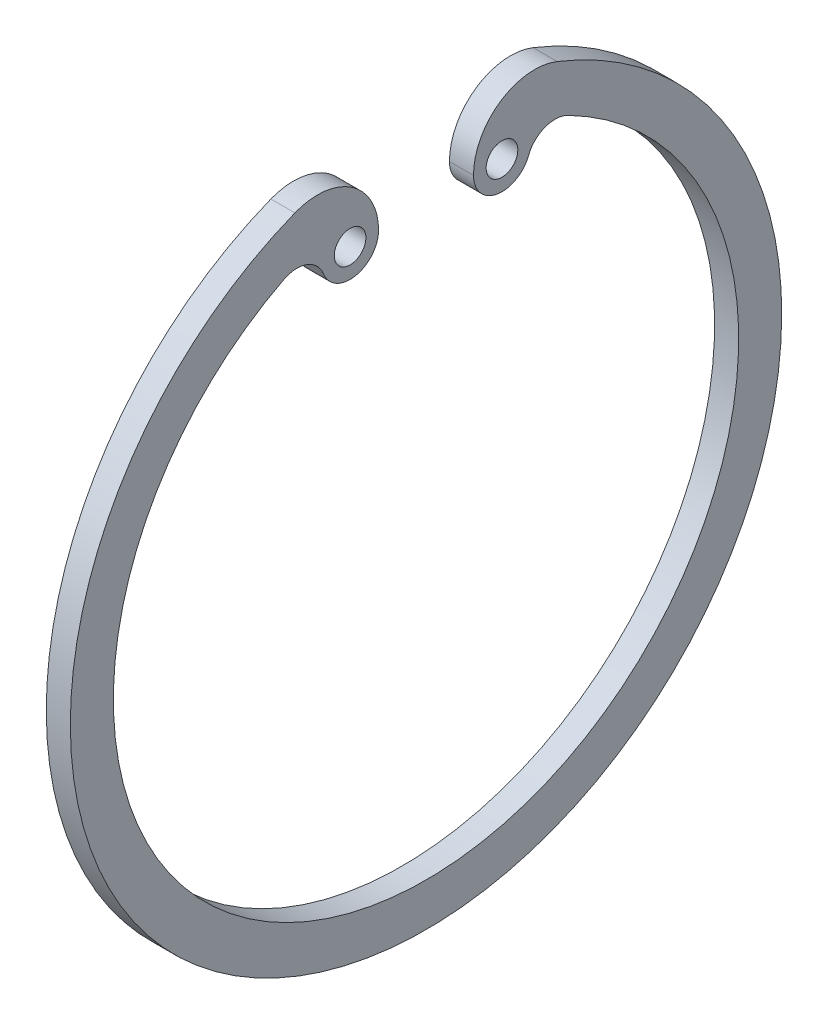
ISO-10303-21;
HEADER;
FILE_DESCRIPTION(('STEP AP214'),'2;1');
FILE_NAME('part.step','',(''),(''),'','','');
FILE_SCHEMA(('AUTOMOTIVE_DESIGN { 1 0 10303 214 1 1 1 1 }'));
ENDSEC;
DATA;
#1=APPLICATION_CONTEXT('core data for automotive mechanical design processes');
#2=APPLICATION_PROTOCOL_DEFINITION('international standard','automotive_design',2000,#1);
#3=PRODUCT_CONTEXT('',#1,'mechanical');
#4=PRODUCT('Part','Part','',(#3));
#5=PRODUCT_RELATED_PRODUCT_CATEGORY('part','',(#4));
#6=PRODUCT_DEFINITION_FORMATION('','',#4);
#7=PRODUCT_DEFINITION_CONTEXT('part definition',#1,'design');
#8=PRODUCT_DEFINITION('design','',#6,#7);
#9=PRODUCT_DEFINITION_SHAPE('','',#8);
#10=(LENGTH_UNIT() NAMED_UNIT(*) SI_UNIT(.MILLI.,.METRE.));
#11=(NAMED_UNIT(*) PLANE_ANGLE_UNIT() SI_UNIT($,.RADIAN.));
#12=(NAMED_UNIT(*) SI_UNIT($,.STERADIAN.) SOLID_ANGLE_UNIT());
#13=UNCERTAINTY_MEASURE_WITH_UNIT(LENGTH_MEASURE(1.E-05),#10,'distance_accuracy_value','');
#14=(GEOMETRIC_REPRESENTATION_CONTEXT(3) GLOBAL_UNCERTAINTY_ASSIGNED_CONTEXT((#13)) GLOBAL_UNIT_ASSIGNED_CONTEXT((#10,
#11,#12)) REPRESENTATION_CONTEXT('',''));
#15=CARTESIAN_POINT('',(0.,0.,0.));
#16=DIRECTION('',(0.,0.,1.));
#17=DIRECTION('',(1.,0.,0.));
#18=AXIS2_PLACEMENT_3D('',#15,#16,#17);
#19=CARTESIAN_POINT('',(1.9,21.6333654339772,7.28901098901099));
#20=DIRECTION('',(-1.,0.,0.));
#21=DIRECTION('',(0.,0.,1.));
#22=AXIS2_PLACEMENT_3D('',#19,#20,#21);
#23=PLANE('',#22);
#24=CARTESIAN_POINT('',(1.9,21.6333654339772,8.57802197802198));
#25=DIRECTION('',(1.,0.,0.));
#26=DIRECTION('',(0.,0.,1.));
#27=AXIS2_PLACEMENT_3D('',#24,#25,#26);
#28=CIRCLE('',#27,4.82802197802198);
#29=CARTESIAN_POINT('',(1.9,21.6333654339772,3.75));
#30=VERTEX_POINT('',#29);
#31=CARTESIAN_POINT('',(1.9,26.1214396180962,10.3576248376815));
#32=VERTEX_POINT('',#31);
#33=EDGE_CURVE('E164',#30,#32,#28,.T.);
#34=ORIENTED_EDGE('',*,*,#33,.T.);
#35=CARTESIAN_POINT('',(1.9,0.,0.));
#36=DIRECTION('',(1.,0.,0.));
#37=DIRECTION('',(0.,0.,-1.));
#38=AXIS2_PLACEMENT_3D('',#35,#36,#37);
#39=CIRCLE('',#38,28.1);
#40=CARTESIAN_POINT('',(1.9,26.1214396180962,-10.3576248376815));
#41=VERTEX_POINT('',#40);
#42=EDGE_CURVE('E100',#32,#41,#39,.T.);
#43=ORIENTED_EDGE('',*,*,#42,.T.);
#44=CARTESIAN_POINT('',(1.9,21.6333654339772,-8.57802197802198));
#45=DIRECTION('',(1.,0.,0.));
#46=DIRECTION('',(0.,0.,-1.));
#47=AXIS2_PLACEMENT_3D('',#44,#45,#46);
#48=CIRCLE('',#47,4.82802197802198);
#49=CARTESIAN_POINT('',(1.9,21.6333654339772,-3.75));
#50=VERTEX_POINT('',#49);
#51=EDGE_CURVE('E185',#41,#50,#48,.T.);
#52=ORIENTED_EDGE('',*,*,#51,.T.);
#53=CARTESIAN_POINT('',(1.9,21.6333654339772,-6.));
#54=DIRECTION('',(1.,0.,0.));
#55=DIRECTION('',(0.,0.,1.));
#56=AXIS2_PLACEMENT_3D('',#53,#54,#55);
#57=CIRCLE('',#56,2.25);
#58=CARTESIAN_POINT('',(1.9,20.8177584908087,-8.09697050867562));
#59=VERTEX_POINT('',#58);
#60=EDGE_CURVE('E199',#50,#59,#57,.T.);
#61=ORIENTED_EDGE('',*,*,#60,.T.);
#62=CARTESIAN_POINT('',(1.9,20.0021515476402,-10.1939410173512));
#63=DIRECTION('',(-1.,0.,0.));
#64=DIRECTION('',(0.,0.,-1.));
#65=AXIS2_PLACEMENT_3D('',#62,#63,#64);
#66=CIRCLE('',#65,2.25);
#67=CARTESIAN_POINT('',(1.9,22.0068215245751,-11.2156054845691));
#68=VERTEX_POINT('',#67);
#69=EDGE_CURVE('E119',#59,#68,#66,.T.);
#70=ORIENTED_EDGE('',*,*,#69,.T.);
#71=CARTESIAN_POINT('',(1.9,0.,0.));
#72=DIRECTION('',(-1.,0.,0.));
#73=DIRECTION('',(0.,0.,-1.));
#74=AXIS2_PLACEMENT_3D('',#71,#72,#73);
#75=CIRCLE('',#74,24.7);
#76=CARTESIAN_POINT('',(1.9,22.0068215245751,11.2156054845691));
#77=VERTEX_POINT('',#76);
#78=EDGE_CURVE('E113',#68,#77,#75,.T.);
#79=ORIENTED_EDGE('',*,*,#78,.T.);
#80=CARTESIAN_POINT('',(1.9,20.0021515476402,10.1939410173512));
#81=DIRECTION('',(-1.,0.,0.));
#82=DIRECTION('',(0.,0.,1.));
#83=AXIS2_PLACEMENT_3D('',#80,#81,#82);
#84=CIRCLE('',#83,2.25);
#85=CARTESIAN_POINT('',(1.9,20.8177584908087,8.09697050867562));
#86=VERTEX_POINT('',#85);
#87=EDGE_CURVE('E117',#77,#86,#84,.T.);
#88=ORIENTED_EDGE('',*,*,#87,.T.);
#89=CARTESIAN_POINT('',(1.9,21.6333654339772,6.));
#90=DIRECTION('',(1.,0.,0.));
#91=DIRECTION('',(0.,0.,-1.));
#92=AXIS2_PLACEMENT_3D('',#89,#90,#91);
#93=CIRCLE('',#92,2.25);
#94=EDGE_CURVE('E57',#86,#30,#93,.T.);
#95=ORIENTED_EDGE('',*,*,#94,.T.);
#96=EDGE_LOOP('',(#34,#43,#52,#61,#70,#79,#88,#95));
#97=FACE_BOUND('',#96,.T.);
#98=CARTESIAN_POINT('',(1.9,21.6333654339772,6.));
#99=DIRECTION('',(1.,0.,0.));
#100=DIRECTION('',(0.,0.,-1.));
#101=AXIS2_PLACEMENT_3D('',#98,#99,#100);
#102=CIRCLE('',#101,1.25);
#103=CARTESIAN_POINT('',(1.9,21.6333654339772,4.75));
#104=VERTEX_POINT('',#103);
#105=EDGE_CURVE('E146',#104,#104,#102,.T.);
#106=ORIENTED_EDGE('',*,*,#105,.F.);
#107=EDGE_LOOP('',(#106));
#108=FACE_BOUND('',#107,.T.);
#109=CARTESIAN_POINT('',(1.9,21.6333654339772,-6.));
#110=DIRECTION('',(1.,0.,0.));
#111=DIRECTION('',(0.,0.,1.));
#112=AXIS2_PLACEMENT_3D('',#109,#110,#111);
#113=CIRCLE('',#112,1.25);
#114=CARTESIAN_POINT('',(1.9,21.6333654339772,-4.75));
#115=VERTEX_POINT('',#114);
#116=EDGE_CURVE('E213',#115,#115,#113,.T.);
#117=ORIENTED_EDGE('',*,*,#116,.F.);
#118=EDGE_LOOP('',(#117));
#119=FACE_BOUND('',#118,.T.);
#120=ADVANCED_FACE('F39',(#97,#108,#119),#23,.F.);
#121=CARTESIAN_POINT('',(0.,21.6333654339772,7.28901098901099));
#122=DIRECTION('',(-1.,0.,0.));
#123=DIRECTION('',(0.,0.,1.));
#124=AXIS2_PLACEMENT_3D('',#121,#122,#123);
#125=PLANE('',#124);
#126=CARTESIAN_POINT('',(0.,21.6333654339772,6.));
#127=DIRECTION('',(1.,0.,0.));
#128=DIRECTION('',(0.,0.,-1.));
#129=AXIS2_PLACEMENT_3D('',#126,#127,#128);
#130=CIRCLE('',#129,1.25);
#131=CARTESIAN_POINT('',(0.,21.6333654339772,4.75));
#132=VERTEX_POINT('',#131);
#133=EDGE_CURVE('E209',#132,#132,#130,.T.);
#134=ORIENTED_EDGE('',*,*,#133,.T.);
#135=EDGE_LOOP('',(#134));
#136=FACE_BOUND('',#135,.T.);
#137=CARTESIAN_POINT('',(0.,21.6333654339772,8.57802197802198));
#138=DIRECTION('',(1.,0.,0.));
#139=DIRECTION('',(0.,0.,1.));
#140=AXIS2_PLACEMENT_3D('',#137,#138,#139);
#141=CIRCLE('',#140,4.82802197802198);
#142=CARTESIAN_POINT('',(0.,21.6333654339772,3.75));
#143=VERTEX_POINT('',#142);
#144=CARTESIAN_POINT('',(0.,26.1214396180962,10.3576248376815));
#145=VERTEX_POINT('',#144);
#146=EDGE_CURVE('E141',#143,#145,#141,.T.);
#147=ORIENTED_EDGE('',*,*,#146,.F.);
#148=CARTESIAN_POINT('',(0.,21.6333654339772,6.));
#149=DIRECTION('',(1.,0.,0.));
#150=DIRECTION('',(0.,0.,-1.));
#151=AXIS2_PLACEMENT_3D('',#148,#149,#150);
#152=CIRCLE('',#151,2.25);
#153=CARTESIAN_POINT('',(0.,20.8177584908087,8.09697050867562));
#154=VERTEX_POINT('',#153);
#155=EDGE_CURVE('E92',#154,#143,#152,.T.);
#156=ORIENTED_EDGE('',*,*,#155,.F.);
#157=CARTESIAN_POINT('',(0.,20.0021515476402,10.1939410173512));
#158=DIRECTION('',(-1.,0.,0.));
#159=DIRECTION('',(0.,0.,1.));
#160=AXIS2_PLACEMENT_3D('',#157,#158,#159);
#161=CIRCLE('',#160,2.25);
#162=CARTESIAN_POINT('',(0.,22.0068215245751,11.2156054845691));
#163=VERTEX_POINT('',#162);
#164=EDGE_CURVE('E86',#163,#154,#161,.T.);
#165=ORIENTED_EDGE('',*,*,#164,.F.);
#166=CARTESIAN_POINT('',(0.,0.,0.));
#167=DIRECTION('',(-1.,0.,0.));
#168=DIRECTION('',(0.,0.,-1.));
#169=AXIS2_PLACEMENT_3D('',#166,#167,#168);
#170=CIRCLE('',#169,24.7);
#171=CARTESIAN_POINT('',(0.,22.0068215245751,-11.2156054845691));
#172=VERTEX_POINT('',#171);
#173=EDGE_CURVE('E128',#172,#163,#170,.T.);
#174=ORIENTED_EDGE('',*,*,#173,.F.);
#175=CARTESIAN_POINT('',(0.,20.0021515476402,-10.1939410173512));
#176=DIRECTION('',(-1.,0.,0.));
#177=DIRECTION('',(0.,0.,-1.));
#178=AXIS2_PLACEMENT_3D('',#175,#176,#177);
#179=CIRCLE('',#178,2.25);
#180=CARTESIAN_POINT('',(0.,20.8177584908087,-8.09697050867562));
#181=VERTEX_POINT('',#180);
#182=EDGE_CURVE('E155',#181,#172,#179,.T.);
#183=ORIENTED_EDGE('',*,*,#182,.F.);
#184=CARTESIAN_POINT('',(0.,21.6333654339772,-6.));
#185=DIRECTION('',(1.,0.,0.));
#186=DIRECTION('',(0.,0.,1.));
#187=AXIS2_PLACEMENT_3D('',#184,#185,#186);
#188=CIRCLE('',#187,2.25);
#189=CARTESIAN_POINT('',(0.,21.6333654339772,-3.75));
#190=VERTEX_POINT('',#189);
#191=EDGE_CURVE('E152',#190,#181,#188,.T.);
#192=ORIENTED_EDGE('',*,*,#191,.F.);
#193=CARTESIAN_POINT('',(0.,21.6333654339772,-8.57802197802198));
#194=DIRECTION('',(1.,0.,0.));
#195=DIRECTION('',(0.,0.,-1.));
#196=AXIS2_PLACEMENT_3D('',#193,#194,#195);
#197=CIRCLE('',#196,4.82802197802198);
#198=CARTESIAN_POINT('',(0.,26.1214396180962,-10.3576248376815));
#199=VERTEX_POINT('',#198);
#200=EDGE_CURVE('E149',#199,#190,#197,.T.);
#201=ORIENTED_EDGE('',*,*,#200,.F.);
#202=CARTESIAN_POINT('',(0.,0.,0.));
#203=DIRECTION('',(1.,0.,0.));
#204=DIRECTION('',(0.,0.,-1.));
#205=AXIS2_PLACEMENT_3D('',#202,#203,#204);
#206=CIRCLE('',#205,28.1);
#207=EDGE_CURVE('E145',#145,#199,#206,.T.);
#208=ORIENTED_EDGE('',*,*,#207,.F.);
#209=EDGE_LOOP('',(#147,#156,#165,#174,#183,#192,#201,#208));
#210=FACE_BOUND('',#209,.T.);
#211=CARTESIAN_POINT('',(0.,21.6333654339772,-6.));
#212=DIRECTION('',(1.,0.,0.));
#213=DIRECTION('',(0.,0.,1.));
#214=AXIS2_PLACEMENT_3D('',#211,#212,#213);
#215=CIRCLE('',#214,1.25);
#216=CARTESIAN_POINT('',(0.,21.6333654339772,-4.75));
#217=VERTEX_POINT('',#216);
#218=EDGE_CURVE('E217',#217,#217,#215,.T.);
#219=ORIENTED_EDGE('',*,*,#218,.T.);
#220=EDGE_LOOP('',(#219));
#221=FACE_BOUND('',#220,.T.);
#222=ADVANCED_FACE('F189',(#136,#210,#221),#125,.T.);
#223=CARTESIAN_POINT('',(1.9,21.6333654339772,8.57802197802198));
#224=DIRECTION('',(-1.,0.,0.));
#225=DIRECTION('',(0.,0.,1.));
#226=AXIS2_PLACEMENT_3D('',#223,#224,#225);
#227=CYLINDRICAL_SURFACE('',#226,4.82802197802198);
#228=ORIENTED_EDGE('',*,*,#146,.T.);
#229=DIRECTION('',(-1.,0.,0.));
#230=VECTOR('',#229,1.);
#231=CARTESIAN_POINT('',(1.9,26.1214396180962,10.3576248376815));
#232=LINE('',#231,#230);
#233=EDGE_CURVE('E11',#32,#145,#232,.T.);
#234=ORIENTED_EDGE('',*,*,#233,.F.);
#235=ORIENTED_EDGE('',*,*,#33,.F.);
#236=DIRECTION('',(-1.,0.,0.));
#237=VECTOR('',#236,1.);
#238=CARTESIAN_POINT('',(1.9,21.6333654339772,3.75));
#239=LINE('',#238,#237);
#240=EDGE_CURVE('E137',#30,#143,#239,.T.);
#241=ORIENTED_EDGE('',*,*,#240,.T.);
#242=EDGE_LOOP('',(#228,#234,#235,#241));
#243=FACE_BOUND('',#242,.T.);
#244=ADVANCED_FACE('F41',(#243),#227,.T.);
#245=CARTESIAN_POINT('',(1.9,0.,0.));
#246=DIRECTION('',(-1.,0.,0.));
#247=DIRECTION('',(0.,0.,1.));
#248=AXIS2_PLACEMENT_3D('',#245,#246,#247);
#249=CYLINDRICAL_SURFACE('',#248,28.1);
#250=ORIENTED_EDGE('',*,*,#207,.T.);
#251=DIRECTION('',(-1.,0.,0.));
#252=VECTOR('',#251,1.);
#253=CARTESIAN_POINT('',(1.9,26.1214396180962,-10.3576248376815));
#254=LINE('',#253,#252);
#255=EDGE_CURVE('E49',#41,#199,#254,.T.);
#256=ORIENTED_EDGE('',*,*,#255,.F.);
#257=ORIENTED_EDGE('',*,*,#42,.F.);
#258=ORIENTED_EDGE('',*,*,#233,.T.);
#259=EDGE_LOOP('',(#250,#256,#257,#258));
#260=FACE_BOUND('',#259,.T.);
#261=ADVANCED_FACE('F251',(#260),#249,.T.);
#262=CARTESIAN_POINT('',(1.9,21.6333654339772,-8.57802197802198));
#263=DIRECTION('',(-1.,0.,0.));
#264=DIRECTION('',(0.,0.,1.));
#265=AXIS2_PLACEMENT_3D('',#262,#263,#264);
#266=CYLINDRICAL_SURFACE('',#265,4.82802197802198);
#267=ORIENTED_EDGE('',*,*,#200,.T.);
#268=DIRECTION('',(-1.,0.,0.));
#269=VECTOR('',#268,1.);
#270=CARTESIAN_POINT('',(1.9,21.6333654339772,-3.75));
#271=LINE('',#270,#269);
#272=EDGE_CURVE('E175',#50,#190,#271,.T.);
#273=ORIENTED_EDGE('',*,*,#272,.F.);
#274=ORIENTED_EDGE('',*,*,#51,.F.);
#275=ORIENTED_EDGE('',*,*,#255,.T.);
#276=EDGE_LOOP('',(#267,#273,#274,#275));
#277=FACE_BOUND('',#276,.T.);
#278=ADVANCED_FACE('F183',(#277),#266,.T.);
#279=CARTESIAN_POINT('',(1.9,21.6333654339772,-6.));
#280=DIRECTION('',(-1.,0.,0.));
#281=DIRECTION('',(0.,0.,1.));
#282=AXIS2_PLACEMENT_3D('',#279,#280,#281);
#283=CYLINDRICAL_SURFACE('',#282,2.25);
#284=ORIENTED_EDGE('',*,*,#191,.T.);
#285=DIRECTION('',(-1.,0.,0.));
#286=VECTOR('',#285,1.);
#287=CARTESIAN_POINT('',(1.9,20.8177584908087,-8.09697050867562));
#288=LINE('',#287,#286);
#289=EDGE_CURVE('E171',#59,#181,#288,.T.);
#290=ORIENTED_EDGE('',*,*,#289,.F.);
#291=ORIENTED_EDGE('',*,*,#60,.F.);
#292=ORIENTED_EDGE('',*,*,#272,.T.);
#293=EDGE_LOOP('',(#284,#290,#291,#292));
#294=FACE_BOUND('',#293,.T.);
#295=ADVANCED_FACE('F194',(#294),#283,.T.);
#296=CARTESIAN_POINT('',(1.9,20.0021515476402,-10.1939410173512));
#297=DIRECTION('',(-1.,0.,0.));
#298=DIRECTION('',(0.,0.,1.));
#299=AXIS2_PLACEMENT_3D('',#296,#297,#298);
#300=CYLINDRICAL_SURFACE('',#299,2.25);
#301=ORIENTED_EDGE('',*,*,#182,.T.);
#302=DIRECTION('',(-1.,0.,0.));
#303=VECTOR('',#302,1.);
#304=CARTESIAN_POINT('',(1.9,22.0068215245751,-11.2156054845691));
#305=LINE('',#304,#303);
#306=EDGE_CURVE('E130',#68,#172,#305,.T.);
#307=ORIENTED_EDGE('',*,*,#306,.F.);
#308=ORIENTED_EDGE('',*,*,#69,.F.);
#309=ORIENTED_EDGE('',*,*,#289,.T.);
#310=EDGE_LOOP('',(#301,#307,#308,#309));
#311=FACE_BOUND('',#310,.T.);
#312=ADVANCED_FACE('F197',(#311),#300,.F.);
#313=CARTESIAN_POINT('',(1.9,0.,0.));
#314=DIRECTION('',(-1.,0.,0.));
#315=DIRECTION('',(0.,0.,1.));
#316=AXIS2_PLACEMENT_3D('',#313,#314,#315);
#317=CYLINDRICAL_SURFACE('',#316,24.7);
#318=ORIENTED_EDGE('',*,*,#173,.T.);
#319=DIRECTION('',(-1.,0.,0.));
#320=VECTOR('',#319,1.);
#321=CARTESIAN_POINT('',(1.9,22.0068215245751,11.2156054845691));
#322=LINE('',#321,#320);
#323=EDGE_CURVE('E125',#77,#163,#322,.T.);
#324=ORIENTED_EDGE('',*,*,#323,.F.);
#325=ORIENTED_EDGE('',*,*,#78,.F.);
#326=ORIENTED_EDGE('',*,*,#306,.T.);
#327=EDGE_LOOP('',(#318,#324,#325,#326));
#328=FACE_BOUND('',#327,.T.);
#329=ADVANCED_FACE('F126',(#328),#317,.F.);
#330=CARTESIAN_POINT('',(1.9,20.0021515476402,10.1939410173512));
#331=DIRECTION('',(-1.,0.,0.));
#332=DIRECTION('',(0.,0.,1.));
#333=AXIS2_PLACEMENT_3D('',#330,#331,#332);
#334=CYLINDRICAL_SURFACE('',#333,2.25);
#335=ORIENTED_EDGE('',*,*,#164,.T.);
#336=DIRECTION('',(-1.,0.,0.));
#337=VECTOR('',#336,1.);
#338=CARTESIAN_POINT('',(1.9,20.8177584908087,8.09697050867562));
#339=LINE('',#338,#337);
#340=EDGE_CURVE('E131',#86,#154,#339,.T.);
#341=ORIENTED_EDGE('',*,*,#340,.F.);
#342=ORIENTED_EDGE('',*,*,#87,.F.);
#343=ORIENTED_EDGE('',*,*,#323,.T.);
#344=EDGE_LOOP('',(#335,#341,#342,#343));
#345=FACE_BOUND('',#344,.T.);
#346=ADVANCED_FACE('F133',(#345),#334,.F.);
#347=CARTESIAN_POINT('',(1.9,21.6333654339772,6.));
#348=DIRECTION('',(-1.,0.,0.));
#349=DIRECTION('',(0.,0.,1.));
#350=AXIS2_PLACEMENT_3D('',#347,#348,#349);
#351=CYLINDRICAL_SURFACE('',#350,2.25);
#352=ORIENTED_EDGE('',*,*,#155,.T.);
#353=ORIENTED_EDGE('',*,*,#240,.F.);
#354=ORIENTED_EDGE('',*,*,#94,.F.);
#355=ORIENTED_EDGE('',*,*,#340,.T.);
#356=EDGE_LOOP('',(#352,#353,#354,#355));
#357=FACE_BOUND('',#356,.T.);
#358=ADVANCED_FACE('F239',(#357),#351,.T.);
#359=CARTESIAN_POINT('',(1.9,21.6333654339772,6.));
#360=DIRECTION('',(-1.,0.,0.));
#361=DIRECTION('',(0.,0.,1.));
#362=AXIS2_PLACEMENT_3D('',#359,#360,#361);
#363=CYLINDRICAL_SURFACE('',#362,1.25);
#364=ORIENTED_EDGE('',*,*,#105,.T.);
#365=EDGE_LOOP('',(#364));
#366=FACE_BOUND('',#365,.T.);
#367=ORIENTED_EDGE('',*,*,#133,.F.);
#368=EDGE_LOOP('',(#367));
#369=FACE_BOUND('',#368,.T.);
#370=ADVANCED_FACE('F236',(#366,#369),#363,.F.);
#371=CARTESIAN_POINT('',(1.9,21.6333654339772,-6.));
#372=DIRECTION('',(-1.,0.,0.));
#373=DIRECTION('',(0.,0.,1.));
#374=AXIS2_PLACEMENT_3D('',#371,#372,#373);
#375=CYLINDRICAL_SURFACE('',#374,1.25);
#376=ORIENTED_EDGE('',*,*,#116,.T.);
#377=EDGE_LOOP('',(#376));
#378=FACE_BOUND('',#377,.T.);
#379=ORIENTED_EDGE('',*,*,#218,.F.);
#380=EDGE_LOOP('',(#379));
#381=FACE_BOUND('',#380,.T.);
#382=ADVANCED_FACE('F225',(#378,#381),#375,.F.);
#383=CLOSED_SHELL('',(#120,#222,#244,#261,#278,#295,#312,#329,#346,#358,#370,#382));
#384=MANIFOLD_SOLID_BREP('B2',#383);
#385=ADVANCED_BREP_SHAPE_REPRESENTATION('',(#18,#384),#14);
#386=SHAPE_DEFINITION_REPRESENTATION(#9,#385);
ENDSEC;
END-ISO-10303-21;
